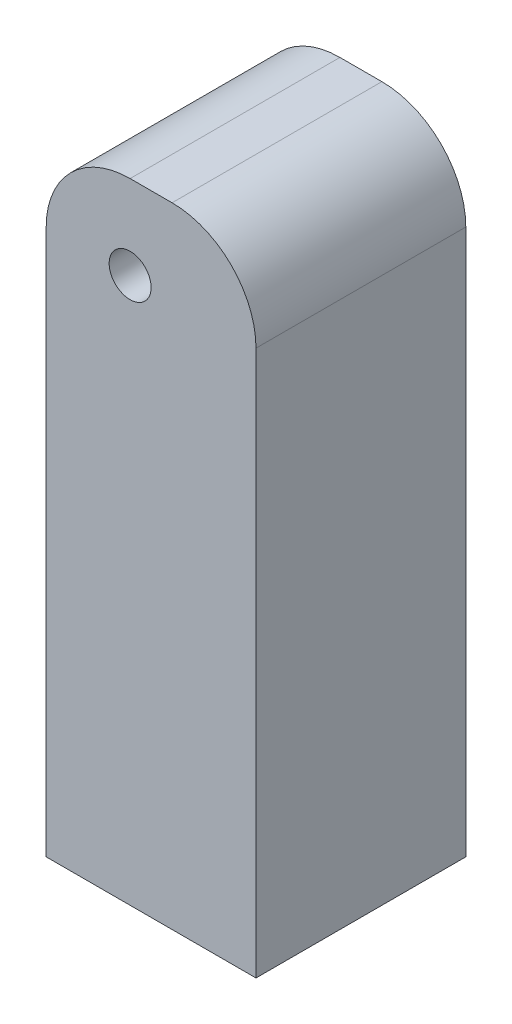
ISO-10303-21;
HEADER;
FILE_DESCRIPTION(('STEP AP214'),'2;1');
FILE_NAME('part.step','',(''),(''),'','','');
FILE_SCHEMA(('AUTOMOTIVE_DESIGN { 1 0 10303 214 1 1 1 1 }'));
ENDSEC;
DATA;
#1=APPLICATION_CONTEXT('core data for automotive mechanical design processes');
#2=APPLICATION_PROTOCOL_DEFINITION('international standard','automotive_design',2000,#1);
#3=PRODUCT_CONTEXT('',#1,'mechanical');
#4=PRODUCT('Part','Part','',(#3));
#5=PRODUCT_RELATED_PRODUCT_CATEGORY('part','',(#4));
#6=PRODUCT_DEFINITION_FORMATION('','',#4);
#7=PRODUCT_DEFINITION_CONTEXT('part definition',#1,'design');
#8=PRODUCT_DEFINITION('design','',#6,#7);
#9=PRODUCT_DEFINITION_SHAPE('','',#8);
#10=(LENGTH_UNIT() NAMED_UNIT(*) SI_UNIT(.MILLI.,.METRE.));
#11=(NAMED_UNIT(*) PLANE_ANGLE_UNIT() SI_UNIT($,.RADIAN.));
#12=(NAMED_UNIT(*) SI_UNIT($,.STERADIAN.) SOLID_ANGLE_UNIT());
#13=UNCERTAINTY_MEASURE_WITH_UNIT(LENGTH_MEASURE(1.E-05),#10,'distance_accuracy_value','');
#14=(GEOMETRIC_REPRESENTATION_CONTEXT(3) GLOBAL_UNCERTAINTY_ASSIGNED_CONTEXT((#13)) GLOBAL_UNIT_ASSIGNED_CONTEXT((#10,
#11,#12)) REPRESENTATION_CONTEXT('',''));
#15=CARTESIAN_POINT('',(0.,0.,0.));
#16=DIRECTION('',(0.,0.,1.));
#17=DIRECTION('',(1.,0.,0.));
#18=AXIS2_PLACEMENT_3D('',#15,#16,#17);
#19=CARTESIAN_POINT('',(153.539634434849,-33.572756569078,7.5));
#20=DIRECTION('',(0.,0.,1.));
#21=DIRECTION('',(1.,0.,0.));
#22=AXIS2_PLACEMENT_3D('',#19,#20,#21);
#23=PLANE('',#22);
#24=DIRECTION('',(0.,1.,0.));
#25=VECTOR('',#24,1.);
#26=CARTESIAN_POINT('',(162.539634434849,-33.572756569078,7.5));
#27=LINE('',#26,#25);
#28=CARTESIAN_POINT('',(162.539634434849,-72.572756569078,7.5));
#29=VERTEX_POINT('',#28);
#30=CARTESIAN_POINT('',(162.539634434849,-33.572756569078,7.5));
#31=VERTEX_POINT('',#30);
#32=EDGE_CURVE('E151',#29,#31,#27,.T.);
#33=ORIENTED_EDGE('',*,*,#32,.T.);
#34=CARTESIAN_POINT('',(156.539634434849,-33.572756569078,7.5));
#35=DIRECTION('',(0.,0.,1.));
#36=DIRECTION('',(-1.,0.,0.));
#37=AXIS2_PLACEMENT_3D('',#34,#35,#36);
#38=CIRCLE('',#37,6.);
#39=CARTESIAN_POINT('',(156.539634434849,-27.572756569078,7.5));
#40=VERTEX_POINT('',#39);
#41=EDGE_CURVE('E99',#31,#40,#38,.T.);
#42=ORIENTED_EDGE('',*,*,#41,.T.);
#43=DIRECTION('',(-1.,0.,0.));
#44=VECTOR('',#43,1.);
#45=CARTESIAN_POINT('',(153.539634434849,-27.572756569078,7.5));
#46=LINE('',#45,#44);
#47=CARTESIAN_POINT('',(153.539634434849,-27.572756569078,7.5));
#48=VERTEX_POINT('',#47);
#49=EDGE_CURVE('E112',#40,#48,#46,.T.);
#50=ORIENTED_EDGE('',*,*,#49,.T.);
#51=CARTESIAN_POINT('',(153.539634434849,-33.572756569078,7.5));
#52=DIRECTION('',(0.,0.,1.));
#53=DIRECTION('',(1.,0.,0.));
#54=AXIS2_PLACEMENT_3D('',#51,#52,#53);
#55=CIRCLE('',#54,6.);
#56=CARTESIAN_POINT('',(147.539634434849,-33.572756569078,7.5));
#57=VERTEX_POINT('',#56);
#58=EDGE_CURVE('E106',#48,#57,#55,.T.);
#59=ORIENTED_EDGE('',*,*,#58,.T.);
#60=DIRECTION('',(0.,-1.,0.));
#61=VECTOR('',#60,1.);
#62=CARTESIAN_POINT('',(147.539634434849,-33.572756569078,7.5));
#63=LINE('',#62,#61);
#64=CARTESIAN_POINT('',(147.539634434849,-72.572756569078,7.5));
#65=VERTEX_POINT('',#64);
#66=EDGE_CURVE('E110',#57,#65,#63,.T.);
#67=ORIENTED_EDGE('',*,*,#66,.T.);
#68=DIRECTION('',(1.,0.,0.));
#69=VECTOR('',#68,1.);
#70=CARTESIAN_POINT('',(147.539634434849,-72.572756569078,7.5));
#71=LINE('',#70,#69);
#72=EDGE_CURVE('E62',#65,#29,#71,.T.);
#73=ORIENTED_EDGE('',*,*,#72,.T.);
#74=EDGE_LOOP('',(#33,#42,#50,#59,#67,#73));
#75=FACE_BOUND('',#74,.T.);
#76=CARTESIAN_POINT('',(153.539634434849,-33.572756569078,7.5));
#77=DIRECTION('',(0.,0.,1.));
#78=DIRECTION('',(1.,0.,0.));
#79=AXIS2_PLACEMENT_3D('',#76,#77,#78);
#80=CIRCLE('',#79,1.50000000000001);
#81=CARTESIAN_POINT('',(155.039634434849,-33.572756569078,7.5));
#82=VERTEX_POINT('',#81);
#83=EDGE_CURVE('E139',#82,#82,#80,.T.);
#84=ORIENTED_EDGE('',*,*,#83,.F.);
#85=EDGE_LOOP('',(#84));
#86=FACE_BOUND('',#85,.T.);
#87=ADVANCED_FACE('F44',(#75,#86),#23,.T.);
#88=CARTESIAN_POINT('',(153.539634434849,-33.572756569078,-7.5));
#89=DIRECTION('',(0.,0.,1.));
#90=DIRECTION('',(1.,0.,0.));
#91=AXIS2_PLACEMENT_3D('',#88,#89,#90);
#92=PLANE('',#91);
#93=DIRECTION('',(0.,1.,0.));
#94=VECTOR('',#93,1.);
#95=CARTESIAN_POINT('',(162.539634434849,-33.572756569078,-7.5));
#96=LINE('',#95,#94);
#97=CARTESIAN_POINT('',(162.539634434849,-72.572756569078,-7.5));
#98=VERTEX_POINT('',#97);
#99=CARTESIAN_POINT('',(162.539634434849,-33.572756569078,-7.5));
#100=VERTEX_POINT('',#99);
#101=EDGE_CURVE('E134',#98,#100,#96,.T.);
#102=ORIENTED_EDGE('',*,*,#101,.F.);
#103=DIRECTION('',(1.,0.,0.));
#104=VECTOR('',#103,1.);
#105=CARTESIAN_POINT('',(147.539634434849,-72.572756569078,-7.5));
#106=LINE('',#105,#104);
#107=CARTESIAN_POINT('',(147.539634434849,-72.572756569078,-7.5));
#108=VERTEX_POINT('',#107);
#109=EDGE_CURVE('E91',#108,#98,#106,.T.);
#110=ORIENTED_EDGE('',*,*,#109,.F.);
#111=DIRECTION('',(0.,-1.,0.));
#112=VECTOR('',#111,1.);
#113=CARTESIAN_POINT('',(147.539634434849,-33.572756569078,-7.5));
#114=LINE('',#113,#112);
#115=CARTESIAN_POINT('',(147.539634434849,-33.572756569078,-7.5));
#116=VERTEX_POINT('',#115);
#117=EDGE_CURVE('E85',#116,#108,#114,.T.);
#118=ORIENTED_EDGE('',*,*,#117,.F.);
#119=CARTESIAN_POINT('',(153.539634434849,-33.572756569078,-7.5));
#120=DIRECTION('',(0.,0.,1.));
#121=DIRECTION('',(1.,0.,0.));
#122=AXIS2_PLACEMENT_3D('',#119,#120,#121);
#123=CIRCLE('',#122,6.);
#124=CARTESIAN_POINT('',(153.539634434849,-27.572756569078,-7.5));
#125=VERTEX_POINT('',#124);
#126=EDGE_CURVE('E121',#125,#116,#123,.T.);
#127=ORIENTED_EDGE('',*,*,#126,.F.);
#128=DIRECTION('',(-1.,0.,0.));
#129=VECTOR('',#128,1.);
#130=CARTESIAN_POINT('',(153.539634434849,-27.572756569078,-7.5));
#131=LINE('',#130,#129);
#132=CARTESIAN_POINT('',(156.539634434849,-27.572756569078,-7.5));
#133=VERTEX_POINT('',#132);
#134=EDGE_CURVE('E142',#133,#125,#131,.T.);
#135=ORIENTED_EDGE('',*,*,#134,.F.);
#136=CARTESIAN_POINT('',(156.539634434849,-33.572756569078,-7.5));
#137=DIRECTION('',(0.,0.,1.));
#138=DIRECTION('',(-1.,0.,0.));
#139=AXIS2_PLACEMENT_3D('',#136,#137,#138);
#140=CIRCLE('',#139,6.);
#141=EDGE_CURVE('E138',#100,#133,#140,.T.);
#142=ORIENTED_EDGE('',*,*,#141,.F.);
#143=EDGE_LOOP('',(#102,#110,#118,#127,#135,#142));
#144=FACE_BOUND('',#143,.T.);
#145=CARTESIAN_POINT('',(153.539634434849,-33.572756569078,-7.5));
#146=DIRECTION('',(0.,0.,1.));
#147=DIRECTION('',(1.,0.,0.));
#148=AXIS2_PLACEMENT_3D('',#145,#146,#147);
#149=CIRCLE('',#148,1.50000000000001);
#150=CARTESIAN_POINT('',(155.039634434849,-33.572756569078,-7.5));
#151=VERTEX_POINT('',#150);
#152=EDGE_CURVE('E202',#151,#151,#149,.T.);
#153=ORIENTED_EDGE('',*,*,#152,.T.);
#154=EDGE_LOOP('',(#153));
#155=FACE_BOUND('',#154,.T.);
#156=ADVANCED_FACE('F164',(#144,#155),#92,.F.);
#157=CARTESIAN_POINT('',(162.539634434849,-33.572756569078,7.5));
#158=DIRECTION('',(-1.,0.,0.));
#159=DIRECTION('',(0.,-1.,0.));
#160=AXIS2_PLACEMENT_3D('',#157,#158,#159);
#161=PLANE('',#160);
#162=ORIENTED_EDGE('',*,*,#101,.T.);
#163=DIRECTION('',(0.,0.,-1.));
#164=VECTOR('',#163,1.);
#165=CARTESIAN_POINT('',(162.539634434849,-33.572756569078,7.5));
#166=LINE('',#165,#164);
#167=EDGE_CURVE('E11',#31,#100,#166,.T.);
#168=ORIENTED_EDGE('',*,*,#167,.F.);
#169=ORIENTED_EDGE('',*,*,#32,.F.);
#170=DIRECTION('',(0.,0.,-1.));
#171=VECTOR('',#170,1.);
#172=CARTESIAN_POINT('',(162.539634434849,-72.572756569078,7.5));
#173=LINE('',#172,#171);
#174=EDGE_CURVE('E130',#29,#98,#173,.T.);
#175=ORIENTED_EDGE('',*,*,#174,.T.);
#176=EDGE_LOOP('',(#162,#168,#169,#175));
#177=FACE_BOUND('',#176,.T.);
#178=ADVANCED_FACE('F46',(#177),#161,.F.);
#179=CARTESIAN_POINT('',(156.539634434849,-33.572756569078,7.5));
#180=DIRECTION('',(0.,0.,-1.));
#181=DIRECTION('',(-1.,0.,0.));
#182=AXIS2_PLACEMENT_3D('',#179,#180,#181);
#183=CYLINDRICAL_SURFACE('',#182,6.);
#184=ORIENTED_EDGE('',*,*,#141,.T.);
#185=DIRECTION('',(0.,0.,-1.));
#186=VECTOR('',#185,1.);
#187=CARTESIAN_POINT('',(156.539634434849,-27.572756569078,7.5));
#188=LINE('',#187,#186);
#189=EDGE_CURVE('E54',#40,#133,#188,.T.);
#190=ORIENTED_EDGE('',*,*,#189,.F.);
#191=ORIENTED_EDGE('',*,*,#41,.F.);
#192=ORIENTED_EDGE('',*,*,#167,.T.);
#193=EDGE_LOOP('',(#184,#190,#191,#192));
#194=FACE_BOUND('',#193,.T.);
#195=ADVANCED_FACE('F263',(#194),#183,.T.);
#196=CARTESIAN_POINT('',(153.539634434849,-27.572756569078,7.5));
#197=DIRECTION('',(0.,-1.,0.));
#198=DIRECTION('',(0.,0.,-1.));
#199=AXIS2_PLACEMENT_3D('',#196,#197,#198);
#200=PLANE('',#199);
#201=ORIENTED_EDGE('',*,*,#134,.T.);
#202=DIRECTION('',(0.,0.,-1.));
#203=VECTOR('',#202,1.);
#204=CARTESIAN_POINT('',(153.539634434849,-27.572756569078,7.5));
#205=LINE('',#204,#203);
#206=EDGE_CURVE('E123',#48,#125,#205,.T.);
#207=ORIENTED_EDGE('',*,*,#206,.F.);
#208=ORIENTED_EDGE('',*,*,#49,.F.);
#209=ORIENTED_EDGE('',*,*,#189,.T.);
#210=EDGE_LOOP('',(#201,#207,#208,#209));
#211=FACE_BOUND('',#210,.T.);
#212=ADVANCED_FACE('F161',(#211),#200,.F.);
#213=CARTESIAN_POINT('',(153.539634434849,-33.572756569078,7.5));
#214=DIRECTION('',(0.,0.,-1.));
#215=DIRECTION('',(-1.,0.,0.));
#216=AXIS2_PLACEMENT_3D('',#213,#214,#215);
#217=CYLINDRICAL_SURFACE('',#216,6.);
#218=ORIENTED_EDGE('',*,*,#126,.T.);
#219=DIRECTION('',(0.,0.,-1.));
#220=VECTOR('',#219,1.);
#221=CARTESIAN_POINT('',(147.539634434849,-33.572756569078,7.5));
#222=LINE('',#221,#220);
#223=EDGE_CURVE('E118',#57,#116,#222,.T.);
#224=ORIENTED_EDGE('',*,*,#223,.F.);
#225=ORIENTED_EDGE('',*,*,#58,.F.);
#226=ORIENTED_EDGE('',*,*,#206,.T.);
#227=EDGE_LOOP('',(#218,#224,#225,#226));
#228=FACE_BOUND('',#227,.T.);
#229=ADVANCED_FACE('F119',(#228),#217,.T.);
#230=CARTESIAN_POINT('',(147.539634434849,-33.572756569078,7.5));
#231=DIRECTION('',(1.,0.,0.));
#232=DIRECTION('',(0.,1.,0.));
#233=AXIS2_PLACEMENT_3D('',#230,#231,#232);
#234=PLANE('',#233);
#235=ORIENTED_EDGE('',*,*,#117,.T.);
#236=DIRECTION('',(0.,0.,-1.));
#237=VECTOR('',#236,1.);
#238=CARTESIAN_POINT('',(147.539634434849,-72.572756569078,7.5));
#239=LINE('',#238,#237);
#240=EDGE_CURVE('E124',#65,#108,#239,.T.);
#241=ORIENTED_EDGE('',*,*,#240,.F.);
#242=ORIENTED_EDGE('',*,*,#66,.F.);
#243=ORIENTED_EDGE('',*,*,#223,.T.);
#244=EDGE_LOOP('',(#235,#241,#242,#243));
#245=FACE_BOUND('',#244,.T.);
#246=ADVANCED_FACE('F126',(#245),#234,.F.);
#247=CARTESIAN_POINT('',(147.539634434849,-72.572756569078,7.5));
#248=DIRECTION('',(0.,1.,0.));
#249=DIRECTION('',(0.,0.,1.));
#250=AXIS2_PLACEMENT_3D('',#247,#248,#249);
#251=PLANE('',#250);
#252=CARTESIAN_POINT('',(155.039634434849,-72.572756569078,0.));
#253=DIRECTION('',(0.,-1.,0.));
#254=DIRECTION('',(0.,0.,-1.));
#255=AXIS2_PLACEMENT_3D('',#252,#253,#254);
#256=CIRCLE('',#255,3.);
#257=CARTESIAN_POINT('',(155.039634434849,-72.572756569078,-3.));
#258=VERTEX_POINT('',#257);
#259=EDGE_CURVE('E203',#258,#258,#256,.T.);
#260=ORIENTED_EDGE('',*,*,#259,.F.);
#261=EDGE_LOOP('',(#260));
#262=FACE_BOUND('',#261,.T.);
#263=ORIENTED_EDGE('',*,*,#109,.T.);
#264=ORIENTED_EDGE('',*,*,#174,.F.);
#265=ORIENTED_EDGE('',*,*,#72,.F.);
#266=ORIENTED_EDGE('',*,*,#240,.T.);
#267=EDGE_LOOP('',(#263,#264,#265,#266));
#268=FACE_BOUND('',#267,.T.);
#269=ADVANCED_FACE('F169',(#262,#268),#251,.F.);
#270=CARTESIAN_POINT('',(153.539634434849,-33.572756569078,7.5));
#271=DIRECTION('',(0.,0.,-1.));
#272=DIRECTION('',(-1.,0.,0.));
#273=AXIS2_PLACEMENT_3D('',#270,#271,#272);
#274=CYLINDRICAL_SURFACE('',#273,1.50000000000001);
#275=ORIENTED_EDGE('',*,*,#83,.T.);
#276=EDGE_LOOP('',(#275));
#277=FACE_BOUND('',#276,.T.);
#278=ORIENTED_EDGE('',*,*,#152,.F.);
#279=EDGE_LOOP('',(#278));
#280=FACE_BOUND('',#279,.T.);
#281=ADVANCED_FACE('F171',(#277,#280),#274,.F.);
#282=CARTESIAN_POINT('',(155.039634434849,-57.572756569078,0.));
#283=DIRECTION('',(0.,-1.,0.));
#284=DIRECTION('',(0.,0.,-1.));
#285=AXIS2_PLACEMENT_3D('',#282,#283,#284);
#286=CYLINDRICAL_SURFACE('',#285,3.);
#287=CARTESIAN_POINT('',(155.039634434849,-57.572756569078,0.));
#288=DIRECTION('',(0.,-1.,0.));
#289=DIRECTION('',(0.,0.,-1.));
#290=AXIS2_PLACEMENT_3D('',#287,#288,#289);
#291=CIRCLE('',#290,3.);
#292=CARTESIAN_POINT('',(155.039634434849,-57.572756569078,-3.));
#293=VERTEX_POINT('',#292);
#294=EDGE_CURVE('E200',#293,#293,#291,.T.);
#295=ORIENTED_EDGE('',*,*,#294,.F.);
#296=EDGE_LOOP('',(#295));
#297=FACE_BOUND('',#296,.T.);
#298=ORIENTED_EDGE('',*,*,#259,.T.);
#299=EDGE_LOOP('',(#298));
#300=FACE_BOUND('',#299,.T.);
#301=ADVANCED_FACE('F178',(#297,#300),#286,.F.);
#302=CARTESIAN_POINT('',(155.039634434849,-57.572756569078,0.));
#303=DIRECTION('',(0.,-1.,0.));
#304=DIRECTION('',(0.,0.,-1.));
#305=AXIS2_PLACEMENT_3D('',#302,#303,#304);
#306=PLANE('',#305);
#307=ORIENTED_EDGE('',*,*,#294,.T.);
#308=EDGE_LOOP('',(#307));
#309=FACE_BOUND('',#308,.T.);
#310=ADVANCED_FACE('F192',(#309),#306,.T.);
#311=CLOSED_SHELL('',(#87,#156,#178,#195,#212,#229,#246,#269,#281,#301,#310));
#312=MANIFOLD_SOLID_BREP('B2',#311);
#313=ADVANCED_BREP_SHAPE_REPRESENTATION('',(#18,#312),#14);
#314=SHAPE_DEFINITION_REPRESENTATION(#9,#313);
ENDSEC;
END-ISO-10303-21;
